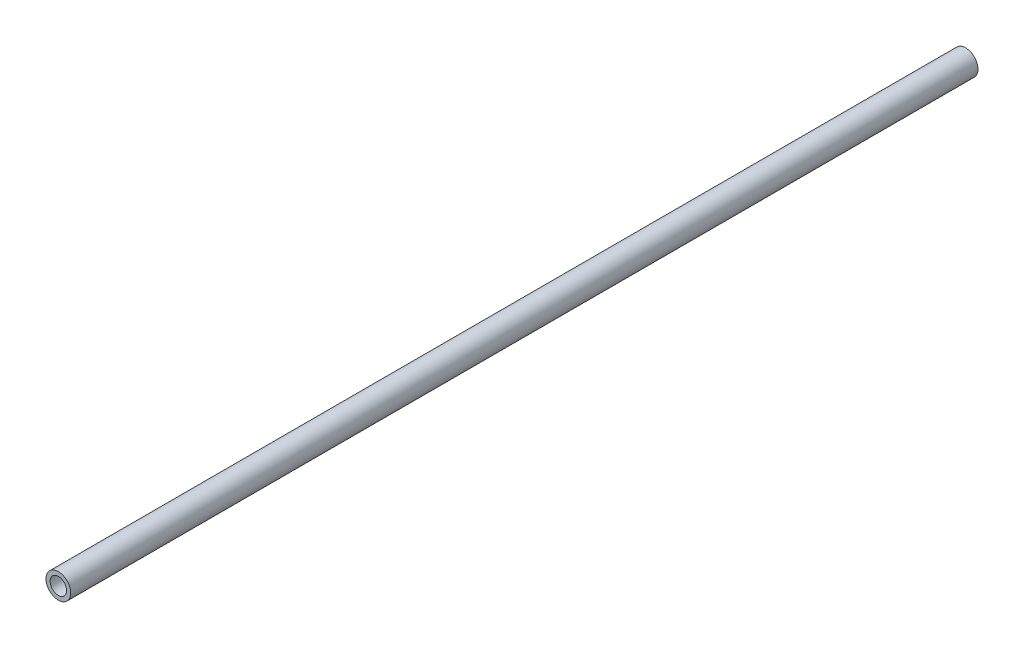
ISO-10303-21;
HEADER;
FILE_DESCRIPTION(('STEP AP214'),'2;1');
FILE_NAME('part.step','',(''),(''),'','','');
FILE_SCHEMA(('AUTOMOTIVE_DESIGN { 1 0 10303 214 1 1 1 1 }'));
ENDSEC;
DATA;
#1=APPLICATION_CONTEXT('core data for automotive mechanical design processes');
#2=APPLICATION_PROTOCOL_DEFINITION('international standard','automotive_design',2000,#1);
#3=PRODUCT_CONTEXT('',#1,'mechanical');
#4=PRODUCT('Part','Part','',(#3));
#5=PRODUCT_RELATED_PRODUCT_CATEGORY('part','',(#4));
#6=PRODUCT_DEFINITION_FORMATION('','',#4);
#7=PRODUCT_DEFINITION_CONTEXT('part definition',#1,'design');
#8=PRODUCT_DEFINITION('design','',#6,#7);
#9=PRODUCT_DEFINITION_SHAPE('','',#8);
#10=(LENGTH_UNIT() NAMED_UNIT(*) SI_UNIT(.MILLI.,.METRE.));
#11=(NAMED_UNIT(*) PLANE_ANGLE_UNIT() SI_UNIT($,.RADIAN.));
#12=(NAMED_UNIT(*) SI_UNIT($,.STERADIAN.) SOLID_ANGLE_UNIT());
#13=UNCERTAINTY_MEASURE_WITH_UNIT(LENGTH_MEASURE(1.E-05),#10,'distance_accuracy_value','');
#14=(GEOMETRIC_REPRESENTATION_CONTEXT(3) GLOBAL_UNCERTAINTY_ASSIGNED_CONTEXT((#13)) GLOBAL_UNIT_ASSIGNED_CONTEXT((#10,
#11,#12)) REPRESENTATION_CONTEXT('',''));
#15=CARTESIAN_POINT('',(0.,0.,0.));
#16=DIRECTION('',(0.,0.,1.));
#17=DIRECTION('',(1.,0.,0.));
#18=AXIS2_PLACEMENT_3D('',#15,#16,#17);
#19=CARTESIAN_POINT('',(0.,0.,558.8));
#20=DIRECTION('',(0.,0.,1.));
#21=DIRECTION('',(1.,0.,0.));
#22=AXIS2_PLACEMENT_3D('',#19,#20,#21);
#23=PLANE('',#22);
#24=CARTESIAN_POINT('',(0.,0.,558.8));
#25=DIRECTION('',(0.,0.,1.));
#26=DIRECTION('',(1.,0.,0.));
#27=AXIS2_PLACEMENT_3D('',#24,#25,#26);
#28=CIRCLE('',#27,7.62);
#29=CARTESIAN_POINT('',(7.62,0.,558.8));
#30=VERTEX_POINT('',#29);
#31=EDGE_CURVE('E10',#30,#30,#28,.T.);
#32=ORIENTED_EDGE('',*,*,#31,.T.);
#33=EDGE_LOOP('',(#32));
#34=FACE_BOUND('',#33,.T.);
#35=CARTESIAN_POINT('',(0.,0.,558.8));
#36=DIRECTION('',(0.,0.,1.));
#37=DIRECTION('',(1.,0.,0.));
#38=AXIS2_PLACEMENT_3D('',#35,#36,#37);
#39=CIRCLE('',#38,5.08);
#40=CARTESIAN_POINT('',(5.08,0.,558.8));
#41=VERTEX_POINT('',#40);
#42=EDGE_CURVE('E41',#41,#41,#39,.T.);
#43=ORIENTED_EDGE('',*,*,#42,.F.);
#44=EDGE_LOOP('',(#43));
#45=FACE_BOUND('',#44,.T.);
#46=ADVANCED_FACE('F30',(#34,#45),#23,.T.);
#47=CARTESIAN_POINT('',(0.,0.,0.));
#48=DIRECTION('',(0.,0.,1.));
#49=DIRECTION('',(1.,0.,0.));
#50=AXIS2_PLACEMENT_3D('',#47,#48,#49);
#51=PLANE('',#50);
#52=CARTESIAN_POINT('',(0.,0.,0.));
#53=DIRECTION('',(0.,0.,1.));
#54=DIRECTION('',(1.,0.,0.));
#55=AXIS2_PLACEMENT_3D('',#52,#53,#54);
#56=CIRCLE('',#55,7.62);
#57=CARTESIAN_POINT('',(7.62,0.,0.));
#58=VERTEX_POINT('',#57);
#59=EDGE_CURVE('E34',#58,#58,#56,.T.);
#60=ORIENTED_EDGE('',*,*,#59,.F.);
#61=EDGE_LOOP('',(#60));
#62=FACE_BOUND('',#61,.T.);
#63=CARTESIAN_POINT('',(0.,0.,0.));
#64=DIRECTION('',(0.,0.,1.));
#65=DIRECTION('',(1.,0.,0.));
#66=AXIS2_PLACEMENT_3D('',#63,#64,#65);
#67=CIRCLE('',#66,5.08);
#68=CARTESIAN_POINT('',(5.08,0.,0.));
#69=VERTEX_POINT('',#68);
#70=EDGE_CURVE('E43',#69,#69,#67,.T.);
#71=ORIENTED_EDGE('',*,*,#70,.T.);
#72=EDGE_LOOP('',(#71));
#73=FACE_BOUND('',#72,.T.);
#74=ADVANCED_FACE('F53',(#62,#73),#51,.F.);
#75=CARTESIAN_POINT('',(0.,0.,558.8));
#76=DIRECTION('',(0.,0.,-1.));
#77=DIRECTION('',(-1.,0.,0.));
#78=AXIS2_PLACEMENT_3D('',#75,#76,#77);
#79=CYLINDRICAL_SURFACE('',#78,7.62);
#80=ORIENTED_EDGE('',*,*,#31,.F.);
#81=EDGE_LOOP('',(#80));
#82=FACE_BOUND('',#81,.T.);
#83=ORIENTED_EDGE('',*,*,#59,.T.);
#84=EDGE_LOOP('',(#83));
#85=FACE_BOUND('',#84,.T.);
#86=ADVANCED_FACE('F32',(#82,#85),#79,.T.);
#87=CARTESIAN_POINT('',(0.,0.,558.8));
#88=DIRECTION('',(0.,0.,-1.));
#89=DIRECTION('',(-1.,0.,0.));
#90=AXIS2_PLACEMENT_3D('',#87,#88,#89);
#91=CYLINDRICAL_SURFACE('',#90,5.08);
#92=ORIENTED_EDGE('',*,*,#42,.T.);
#93=EDGE_LOOP('',(#92));
#94=FACE_BOUND('',#93,.T.);
#95=ORIENTED_EDGE('',*,*,#70,.F.);
#96=EDGE_LOOP('',(#95));
#97=FACE_BOUND('',#96,.T.);
#98=ADVANCED_FACE('F49',(#94,#97),#91,.F.);
#99=CLOSED_SHELL('',(#46,#74,#86,#98));
#100=MANIFOLD_SOLID_BREP('B2',#99);
#101=ADVANCED_BREP_SHAPE_REPRESENTATION('',(#18,#100),#14);
#102=SHAPE_DEFINITION_REPRESENTATION(#9,#101);
ENDSEC;
END-ISO-10303-21;
